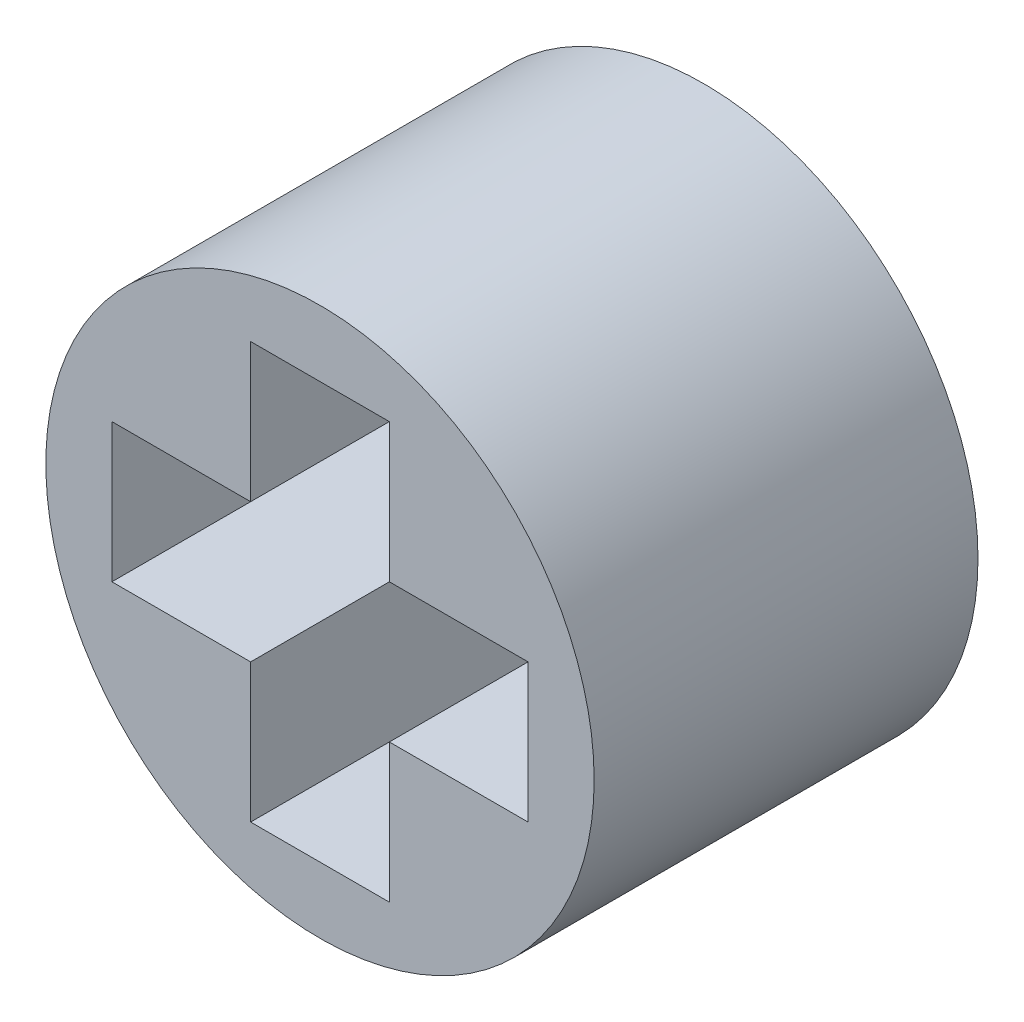
ISO-10303-21;
HEADER;
FILE_DESCRIPTION(('STEP AP214'),'2;1');
FILE_NAME('part.step','',(''),(''),'','','');
FILE_SCHEMA(('AUTOMOTIVE_DESIGN { 1 0 10303 214 1 1 1 1 }'));
ENDSEC;
DATA;
#1=APPLICATION_CONTEXT('core data for automotive mechanical design processes');
#2=APPLICATION_PROTOCOL_DEFINITION('international standard','automotive_design',2000,#1);
#3=PRODUCT_CONTEXT('',#1,'mechanical');
#4=PRODUCT('Part','Part','',(#3));
#5=PRODUCT_RELATED_PRODUCT_CATEGORY('part','',(#4));
#6=PRODUCT_DEFINITION_FORMATION('','',#4);
#7=PRODUCT_DEFINITION_CONTEXT('part definition',#1,'design');
#8=PRODUCT_DEFINITION('design','',#6,#7);
#9=PRODUCT_DEFINITION_SHAPE('','',#8);
#10=(LENGTH_UNIT() NAMED_UNIT(*) SI_UNIT(.MILLI.,.METRE.));
#11=(NAMED_UNIT(*) PLANE_ANGLE_UNIT() SI_UNIT($,.RADIAN.));
#12=(NAMED_UNIT(*) SI_UNIT($,.STERADIAN.) SOLID_ANGLE_UNIT());
#13=UNCERTAINTY_MEASURE_WITH_UNIT(LENGTH_MEASURE(1.E-05),#10,'distance_accuracy_value','');
#14=(GEOMETRIC_REPRESENTATION_CONTEXT(3) GLOBAL_UNCERTAINTY_ASSIGNED_CONTEXT((#13)) GLOBAL_UNIT_ASSIGNED_CONTEXT((#10,
#11,#12)) REPRESENTATION_CONTEXT('',''));
#15=CARTESIAN_POINT('',(0.,0.,0.));
#16=DIRECTION('',(0.,0.,1.));
#17=DIRECTION('',(1.,0.,0.));
#18=AXIS2_PLACEMENT_3D('',#15,#16,#17);
#19=CARTESIAN_POINT('',(0.,0.,7.));
#20=DIRECTION('',(0.,0.,1.));
#21=DIRECTION('',(1.,0.,0.));
#22=AXIS2_PLACEMENT_3D('',#19,#20,#21);
#23=PLANE('',#22);
#24=CARTESIAN_POINT('',(0.,0.,7.));
#25=DIRECTION('',(0.,0.,1.));
#26=DIRECTION('',(1.,0.,0.));
#27=AXIS2_PLACEMENT_3D('',#24,#25,#26);
#28=CIRCLE('',#27,5.);
#29=CARTESIAN_POINT('',(5.,0.,7.));
#30=VERTEX_POINT('',#29);
#31=EDGE_CURVE('E11',#30,#30,#28,.T.);
#32=ORIENTED_EDGE('',*,*,#31,.T.);
#33=EDGE_LOOP('',(#32));
#34=FACE_BOUND('',#33,.T.);
#35=DIRECTION('',(0.,-1.,0.));
#36=VECTOR('',#35,1.);
#37=CARTESIAN_POINT('',(-1.26491106406735,-3.79473319220206,7.));
#38=LINE('',#37,#36);
#39=CARTESIAN_POINT('',(-1.26491106406735,-1.26491106406735,7.));
#40=VERTEX_POINT('',#39);
#41=CARTESIAN_POINT('',(-1.26491106406735,-3.79473319220206,7.));
#42=VERTEX_POINT('',#41);
#43=EDGE_CURVE('E130',#40,#42,#38,.T.);
#44=ORIENTED_EDGE('',*,*,#43,.F.);
#45=DIRECTION('',(1.,0.,0.));
#46=VECTOR('',#45,1.);
#47=CARTESIAN_POINT('',(-1.26491106406735,-1.26491106406735,7.));
#48=LINE('',#47,#46);
#49=CARTESIAN_POINT('',(-3.79473319220205,-1.26491106406735,7.));
#50=VERTEX_POINT('',#49);
#51=EDGE_CURVE('E122',#50,#40,#48,.T.);
#52=ORIENTED_EDGE('',*,*,#51,.F.);
#53=DIRECTION('',(0.,-1.,0.));
#54=VECTOR('',#53,1.);
#55=CARTESIAN_POINT('',(-3.79473319220205,1.26491106406735,7.));
#56=LINE('',#55,#54);
#57=CARTESIAN_POINT('',(-3.79473319220205,1.26491106406735,7.));
#58=VERTEX_POINT('',#57);
#59=EDGE_CURVE('E162',#58,#50,#56,.T.);
#60=ORIENTED_EDGE('',*,*,#59,.F.);
#61=DIRECTION('',(-1.,0.,0.));
#62=VECTOR('',#61,1.);
#63=CARTESIAN_POINT('',(-3.79473319220205,1.26491106406735,7.));
#64=LINE('',#63,#62);
#65=CARTESIAN_POINT('',(-1.26491106406735,1.26491106406735,7.));
#66=VERTEX_POINT('',#65);
#67=EDGE_CURVE('E160',#66,#58,#64,.T.);
#68=ORIENTED_EDGE('',*,*,#67,.F.);
#69=DIRECTION('',(0.,-1.,0.));
#70=VECTOR('',#69,1.);
#71=CARTESIAN_POINT('',(-1.26491106406735,1.26491106406735,7.));
#72=LINE('',#71,#70);
#73=CARTESIAN_POINT('',(-1.26491106406735,3.79473319220206,7.));
#74=VERTEX_POINT('',#73);
#75=EDGE_CURVE('E158',#74,#66,#72,.T.);
#76=ORIENTED_EDGE('',*,*,#75,.F.);
#77=DIRECTION('',(-1.,0.,0.));
#78=VECTOR('',#77,1.);
#79=CARTESIAN_POINT('',(-1.26491106406735,3.79473319220206,7.));
#80=LINE('',#79,#78);
#81=CARTESIAN_POINT('',(1.26491106406735,3.79473319220206,7.));
#82=VERTEX_POINT('',#81);
#83=EDGE_CURVE('E156',#82,#74,#80,.T.);
#84=ORIENTED_EDGE('',*,*,#83,.F.);
#85=DIRECTION('',(0.,1.,0.));
#86=VECTOR('',#85,1.);
#87=CARTESIAN_POINT('',(1.26491106406735,3.79473319220206,7.));
#88=LINE('',#87,#86);
#89=CARTESIAN_POINT('',(1.26491106406735,1.26491106406735,7.));
#90=VERTEX_POINT('',#89);
#91=EDGE_CURVE('E154',#90,#82,#88,.T.);
#92=ORIENTED_EDGE('',*,*,#91,.F.);
#93=DIRECTION('',(-1.,0.,0.));
#94=VECTOR('',#93,1.);
#95=CARTESIAN_POINT('',(1.26491106406735,1.26491106406735,7.));
#96=LINE('',#95,#94);
#97=CARTESIAN_POINT('',(3.79473319220205,1.26491106406735,7.));
#98=VERTEX_POINT('',#97);
#99=EDGE_CURVE('E152',#98,#90,#96,.T.);
#100=ORIENTED_EDGE('',*,*,#99,.F.);
#101=DIRECTION('',(0.,1.,0.));
#102=VECTOR('',#101,1.);
#103=CARTESIAN_POINT('',(3.79473319220205,1.26491106406735,7.));
#104=LINE('',#103,#102);
#105=CARTESIAN_POINT('',(3.79473319220205,-1.26491106406735,7.));
#106=VERTEX_POINT('',#105);
#107=EDGE_CURVE('E150',#106,#98,#104,.T.);
#108=ORIENTED_EDGE('',*,*,#107,.F.);
#109=DIRECTION('',(1.,0.,0.));
#110=VECTOR('',#109,1.);
#111=CARTESIAN_POINT('',(3.79473319220205,-1.26491106406735,7.));
#112=LINE('',#111,#110);
#113=CARTESIAN_POINT('',(1.26491106406735,-1.26491106406735,7.));
#114=VERTEX_POINT('',#113);
#115=EDGE_CURVE('E148',#114,#106,#112,.T.);
#116=ORIENTED_EDGE('',*,*,#115,.F.);
#117=DIRECTION('',(0.,1.,0.));
#118=VECTOR('',#117,1.);
#119=CARTESIAN_POINT('',(1.26491106406735,-1.26491106406735,7.));
#120=LINE('',#119,#118);
#121=CARTESIAN_POINT('',(1.26491106406735,-3.79473319220206,7.));
#122=VERTEX_POINT('',#121);
#123=EDGE_CURVE('E144',#122,#114,#120,.T.);
#124=ORIENTED_EDGE('',*,*,#123,.F.);
#125=DIRECTION('',(1.,0.,0.));
#126=VECTOR('',#125,1.);
#127=CARTESIAN_POINT('',(1.26491106406735,-3.79473319220206,7.));
#128=LINE('',#127,#126);
#129=EDGE_CURVE('E142',#42,#122,#128,.T.);
#130=ORIENTED_EDGE('',*,*,#129,.F.);
#131=EDGE_LOOP('',(#44,#52,#60,#68,#76,#84,#92,#100,#108,#116,#124,#130));
#132=FACE_BOUND('',#131,.T.);
#133=ADVANCED_FACE('F33',(#34,#132),#23,.T.);
#134=CARTESIAN_POINT('',(0.,0.,0.));
#135=DIRECTION('',(0.,0.,1.));
#136=DIRECTION('',(1.,0.,0.));
#137=AXIS2_PLACEMENT_3D('',#134,#135,#136);
#138=PLANE('',#137);
#139=CARTESIAN_POINT('',(0.,0.,0.));
#140=DIRECTION('',(0.,0.,1.));
#141=DIRECTION('',(1.,0.,0.));
#142=AXIS2_PLACEMENT_3D('',#139,#140,#141);
#143=CIRCLE('',#142,5.);
#144=CARTESIAN_POINT('',(5.,0.,0.));
#145=VERTEX_POINT('',#144);
#146=EDGE_CURVE('E37',#145,#145,#143,.T.);
#147=ORIENTED_EDGE('',*,*,#146,.F.);
#148=EDGE_LOOP('',(#147));
#149=FACE_BOUND('',#148,.T.);
#150=DIRECTION('',(1.,0.,0.));
#151=VECTOR('',#150,1.);
#152=CARTESIAN_POINT('',(-1.26491106406735,-1.26491106406735,0.));
#153=LINE('',#152,#151);
#154=CARTESIAN_POINT('',(-3.79473319220205,-1.26491106406735,0.));
#155=VERTEX_POINT('',#154);
#156=CARTESIAN_POINT('',(-1.26491106406735,-1.26491106406735,0.));
#157=VERTEX_POINT('',#156);
#158=EDGE_CURVE('E56',#155,#157,#153,.T.);
#159=ORIENTED_EDGE('',*,*,#158,.T.);
#160=DIRECTION('',(0.,-1.,0.));
#161=VECTOR('',#160,1.);
#162=CARTESIAN_POINT('',(-1.26491106406735,-3.79473319220206,0.));
#163=LINE('',#162,#161);
#164=CARTESIAN_POINT('',(-1.26491106406735,-3.79473319220206,0.));
#165=VERTEX_POINT('',#164);
#166=EDGE_CURVE('E137',#157,#165,#163,.T.);
#167=ORIENTED_EDGE('',*,*,#166,.T.);
#168=DIRECTION('',(1.,0.,0.));
#169=VECTOR('',#168,1.);
#170=CARTESIAN_POINT('',(1.26491106406735,-3.79473319220206,0.));
#171=LINE('',#170,#169);
#172=CARTESIAN_POINT('',(1.26491106406735,-3.79473319220206,0.));
#173=VERTEX_POINT('',#172);
#174=EDGE_CURVE('E166',#165,#173,#171,.T.);
#175=ORIENTED_EDGE('',*,*,#174,.T.);
#176=DIRECTION('',(0.,1.,0.));
#177=VECTOR('',#176,1.);
#178=CARTESIAN_POINT('',(1.26491106406735,-1.26491106406735,0.));
#179=LINE('',#178,#177);
#180=CARTESIAN_POINT('',(1.26491106406735,-1.26491106406735,0.));
#181=VERTEX_POINT('',#180);
#182=EDGE_CURVE('E169',#173,#181,#179,.T.);
#183=ORIENTED_EDGE('',*,*,#182,.T.);
#184=DIRECTION('',(1.,0.,0.));
#185=VECTOR('',#184,1.);
#186=CARTESIAN_POINT('',(3.79473319220205,-1.26491106406735,0.));
#187=LINE('',#186,#185);
#188=CARTESIAN_POINT('',(3.79473319220205,-1.26491106406735,0.));
#189=VERTEX_POINT('',#188);
#190=EDGE_CURVE('E172',#181,#189,#187,.T.);
#191=ORIENTED_EDGE('',*,*,#190,.T.);
#192=DIRECTION('',(0.,1.,0.));
#193=VECTOR('',#192,1.);
#194=CARTESIAN_POINT('',(3.79473319220205,1.26491106406735,0.));
#195=LINE('',#194,#193);
#196=CARTESIAN_POINT('',(3.79473319220205,1.26491106406735,0.));
#197=VERTEX_POINT('',#196);
#198=EDGE_CURVE('E175',#189,#197,#195,.T.);
#199=ORIENTED_EDGE('',*,*,#198,.T.);
#200=DIRECTION('',(-1.,0.,0.));
#201=VECTOR('',#200,1.);
#202=CARTESIAN_POINT('',(1.26491106406735,1.26491106406735,0.));
#203=LINE('',#202,#201);
#204=CARTESIAN_POINT('',(1.26491106406735,1.26491106406735,0.));
#205=VERTEX_POINT('',#204);
#206=EDGE_CURVE('E178',#197,#205,#203,.T.);
#207=ORIENTED_EDGE('',*,*,#206,.T.);
#208=DIRECTION('',(0.,1.,0.));
#209=VECTOR('',#208,1.);
#210=CARTESIAN_POINT('',(1.26491106406735,3.79473319220206,0.));
#211=LINE('',#210,#209);
#212=CARTESIAN_POINT('',(1.26491106406735,3.79473319220206,0.));
#213=VERTEX_POINT('',#212);
#214=EDGE_CURVE('E181',#205,#213,#211,.T.);
#215=ORIENTED_EDGE('',*,*,#214,.T.);
#216=DIRECTION('',(-1.,0.,0.));
#217=VECTOR('',#216,1.);
#218=CARTESIAN_POINT('',(-1.26491106406735,3.79473319220206,0.));
#219=LINE('',#218,#217);
#220=CARTESIAN_POINT('',(-1.26491106406735,3.79473319220206,0.));
#221=VERTEX_POINT('',#220);
#222=EDGE_CURVE('E184',#213,#221,#219,.T.);
#223=ORIENTED_EDGE('',*,*,#222,.T.);
#224=DIRECTION('',(0.,-1.,0.));
#225=VECTOR('',#224,1.);
#226=CARTESIAN_POINT('',(-1.26491106406735,1.26491106406735,0.));
#227=LINE('',#226,#225);
#228=CARTESIAN_POINT('',(-1.26491106406735,1.26491106406735,0.));
#229=VERTEX_POINT('',#228);
#230=EDGE_CURVE('E187',#221,#229,#227,.T.);
#231=ORIENTED_EDGE('',*,*,#230,.T.);
#232=DIRECTION('',(-1.,0.,0.));
#233=VECTOR('',#232,1.);
#234=CARTESIAN_POINT('',(-3.79473319220205,1.26491106406735,0.));
#235=LINE('',#234,#233);
#236=CARTESIAN_POINT('',(-3.79473319220205,1.26491106406735,0.));
#237=VERTEX_POINT('',#236);
#238=EDGE_CURVE('E190',#229,#237,#235,.T.);
#239=ORIENTED_EDGE('',*,*,#238,.T.);
#240=DIRECTION('',(0.,-1.,0.));
#241=VECTOR('',#240,1.);
#242=CARTESIAN_POINT('',(-3.79473319220205,1.26491106406735,0.));
#243=LINE('',#242,#241);
#244=EDGE_CURVE('E131',#237,#155,#243,.T.);
#245=ORIENTED_EDGE('',*,*,#244,.T.);
#246=EDGE_LOOP('',(#159,#167,#175,#183,#191,#199,#207,#215,#223,#231,#239,#245));
#247=FACE_BOUND('',#246,.T.);
#248=ADVANCED_FACE('F219',(#149,#247),#138,.F.);
#249=CARTESIAN_POINT('',(0.,0.,7.));
#250=DIRECTION('',(0.,0.,-1.));
#251=DIRECTION('',(-1.,0.,0.));
#252=AXIS2_PLACEMENT_3D('',#249,#250,#251);
#253=CYLINDRICAL_SURFACE('',#252,5.);
#254=ORIENTED_EDGE('',*,*,#31,.F.);
#255=EDGE_LOOP('',(#254));
#256=FACE_BOUND('',#255,.T.);
#257=ORIENTED_EDGE('',*,*,#146,.T.);
#258=EDGE_LOOP('',(#257));
#259=FACE_BOUND('',#258,.T.);
#260=ADVANCED_FACE('F35',(#256,#259),#253,.T.);
#261=CARTESIAN_POINT('',(-1.26491106406735,-1.26491106406735,7.));
#262=DIRECTION('',(0.,1.,0.));
#263=DIRECTION('',(0.,0.,1.));
#264=AXIS2_PLACEMENT_3D('',#261,#262,#263);
#265=PLANE('',#264);
#266=ORIENTED_EDGE('',*,*,#158,.F.);
#267=DIRECTION('',(0.,0.,-1.));
#268=VECTOR('',#267,1.);
#269=CARTESIAN_POINT('',(-3.79473319220205,-1.26491106406735,7.));
#270=LINE('',#269,#268);
#271=EDGE_CURVE('E126',#50,#155,#270,.T.);
#272=ORIENTED_EDGE('',*,*,#271,.F.);
#273=ORIENTED_EDGE('',*,*,#51,.T.);
#274=DIRECTION('',(0.,0.,-1.));
#275=VECTOR('',#274,1.);
#276=CARTESIAN_POINT('',(-1.26491106406735,-1.26491106406735,7.));
#277=LINE('',#276,#275);
#278=EDGE_CURVE('E125',#40,#157,#277,.T.);
#279=ORIENTED_EDGE('',*,*,#278,.T.);
#280=EDGE_LOOP('',(#266,#272,#273,#279));
#281=FACE_BOUND('',#280,.T.);
#282=ADVANCED_FACE('F124',(#281),#265,.T.);
#283=CARTESIAN_POINT('',(-1.26491106406735,-3.79473319220206,7.));
#284=DIRECTION('',(1.,0.,0.));
#285=DIRECTION('',(0.,0.,-1.));
#286=AXIS2_PLACEMENT_3D('',#283,#284,#285);
#287=PLANE('',#286);
#288=ORIENTED_EDGE('',*,*,#166,.F.);
#289=ORIENTED_EDGE('',*,*,#278,.F.);
#290=ORIENTED_EDGE('',*,*,#43,.T.);
#291=DIRECTION('',(0.,0.,-1.));
#292=VECTOR('',#291,1.);
#293=CARTESIAN_POINT('',(-1.26491106406735,-3.79473319220206,7.));
#294=LINE('',#293,#292);
#295=EDGE_CURVE('E138',#42,#165,#294,.T.);
#296=ORIENTED_EDGE('',*,*,#295,.T.);
#297=EDGE_LOOP('',(#288,#289,#290,#296));
#298=FACE_BOUND('',#297,.T.);
#299=ADVANCED_FACE('F134',(#298),#287,.T.);
#300=CARTESIAN_POINT('',(1.26491106406735,-3.79473319220206,7.));
#301=DIRECTION('',(0.,1.,0.));
#302=DIRECTION('',(0.,0.,1.));
#303=AXIS2_PLACEMENT_3D('',#300,#301,#302);
#304=PLANE('',#303);
#305=ORIENTED_EDGE('',*,*,#174,.F.);
#306=ORIENTED_EDGE('',*,*,#295,.F.);
#307=ORIENTED_EDGE('',*,*,#129,.T.);
#308=DIRECTION('',(0.,0.,-1.));
#309=VECTOR('',#308,1.);
#310=CARTESIAN_POINT('',(1.26491106406735,-3.79473319220206,7.));
#311=LINE('',#310,#309);
#312=EDGE_CURVE('E211',#122,#173,#311,.T.);
#313=ORIENTED_EDGE('',*,*,#312,.T.);
#314=EDGE_LOOP('',(#305,#306,#307,#313));
#315=FACE_BOUND('',#314,.T.);
#316=ADVANCED_FACE('F215',(#315),#304,.T.);
#317=CARTESIAN_POINT('',(1.26491106406735,-1.26491106406735,7.));
#318=DIRECTION('',(-1.,0.,0.));
#319=DIRECTION('',(0.,0.,1.));
#320=AXIS2_PLACEMENT_3D('',#317,#318,#319);
#321=PLANE('',#320);
#322=ORIENTED_EDGE('',*,*,#182,.F.);
#323=ORIENTED_EDGE('',*,*,#312,.F.);
#324=ORIENTED_EDGE('',*,*,#123,.T.);
#325=DIRECTION('',(0.,0.,-1.));
#326=VECTOR('',#325,1.);
#327=CARTESIAN_POINT('',(1.26491106406735,-1.26491106406735,7.));
#328=LINE('',#327,#326);
#329=EDGE_CURVE('E209',#114,#181,#328,.T.);
#330=ORIENTED_EDGE('',*,*,#329,.T.);
#331=EDGE_LOOP('',(#322,#323,#324,#330));
#332=FACE_BOUND('',#331,.T.);
#333=ADVANCED_FACE('F257',(#332),#321,.T.);
#334=CARTESIAN_POINT('',(3.79473319220205,-1.26491106406735,7.));
#335=DIRECTION('',(0.,1.,0.));
#336=DIRECTION('',(0.,0.,1.));
#337=AXIS2_PLACEMENT_3D('',#334,#335,#336);
#338=PLANE('',#337);
#339=ORIENTED_EDGE('',*,*,#190,.F.);
#340=ORIENTED_EDGE('',*,*,#329,.F.);
#341=ORIENTED_EDGE('',*,*,#115,.T.);
#342=DIRECTION('',(0.,0.,-1.));
#343=VECTOR('',#342,1.);
#344=CARTESIAN_POINT('',(3.79473319220205,-1.26491106406735,7.));
#345=LINE('',#344,#343);
#346=EDGE_CURVE('E207',#106,#189,#345,.T.);
#347=ORIENTED_EDGE('',*,*,#346,.T.);
#348=EDGE_LOOP('',(#339,#340,#341,#347));
#349=FACE_BOUND('',#348,.T.);
#350=ADVANCED_FACE('F255',(#349),#338,.T.);
#351=CARTESIAN_POINT('',(3.79473319220205,1.26491106406735,7.));
#352=DIRECTION('',(-1.,0.,0.));
#353=DIRECTION('',(0.,0.,1.));
#354=AXIS2_PLACEMENT_3D('',#351,#352,#353);
#355=PLANE('',#354);
#356=ORIENTED_EDGE('',*,*,#198,.F.);
#357=ORIENTED_EDGE('',*,*,#346,.F.);
#358=ORIENTED_EDGE('',*,*,#107,.T.);
#359=DIRECTION('',(0.,0.,-1.));
#360=VECTOR('',#359,1.);
#361=CARTESIAN_POINT('',(3.79473319220205,1.26491106406735,7.));
#362=LINE('',#361,#360);
#363=EDGE_CURVE('E205',#98,#197,#362,.T.);
#364=ORIENTED_EDGE('',*,*,#363,.T.);
#365=EDGE_LOOP('',(#356,#357,#358,#364));
#366=FACE_BOUND('',#365,.T.);
#367=ADVANCED_FACE('F249',(#366),#355,.T.);
#368=CARTESIAN_POINT('',(1.26491106406735,1.26491106406735,7.));
#369=DIRECTION('',(0.,-1.,0.));
#370=DIRECTION('',(0.,0.,-1.));
#371=AXIS2_PLACEMENT_3D('',#368,#369,#370);
#372=PLANE('',#371);
#373=ORIENTED_EDGE('',*,*,#206,.F.);
#374=ORIENTED_EDGE('',*,*,#363,.F.);
#375=ORIENTED_EDGE('',*,*,#99,.T.);
#376=DIRECTION('',(0.,0.,-1.));
#377=VECTOR('',#376,1.);
#378=CARTESIAN_POINT('',(1.26491106406735,1.26491106406735,7.));
#379=LINE('',#378,#377);
#380=EDGE_CURVE('E203',#90,#205,#379,.T.);
#381=ORIENTED_EDGE('',*,*,#380,.T.);
#382=EDGE_LOOP('',(#373,#374,#375,#381));
#383=FACE_BOUND('',#382,.T.);
#384=ADVANCED_FACE('F245',(#383),#372,.T.);
#385=CARTESIAN_POINT('',(1.26491106406735,3.79473319220206,7.));
#386=DIRECTION('',(-1.,0.,0.));
#387=DIRECTION('',(0.,0.,1.));
#388=AXIS2_PLACEMENT_3D('',#385,#386,#387);
#389=PLANE('',#388);
#390=ORIENTED_EDGE('',*,*,#214,.F.);
#391=ORIENTED_EDGE('',*,*,#380,.F.);
#392=ORIENTED_EDGE('',*,*,#91,.T.);
#393=DIRECTION('',(0.,0.,-1.));
#394=VECTOR('',#393,1.);
#395=CARTESIAN_POINT('',(1.26491106406735,3.79473319220206,7.));
#396=LINE('',#395,#394);
#397=EDGE_CURVE('E201',#82,#213,#396,.T.);
#398=ORIENTED_EDGE('',*,*,#397,.T.);
#399=EDGE_LOOP('',(#390,#391,#392,#398));
#400=FACE_BOUND('',#399,.T.);
#401=ADVANCED_FACE('F242',(#400),#389,.T.);
#402=CARTESIAN_POINT('',(-1.26491106406735,3.79473319220206,7.));
#403=DIRECTION('',(0.,-1.,0.));
#404=DIRECTION('',(0.,0.,-1.));
#405=AXIS2_PLACEMENT_3D('',#402,#403,#404);
#406=PLANE('',#405);
#407=ORIENTED_EDGE('',*,*,#222,.F.);
#408=ORIENTED_EDGE('',*,*,#397,.F.);
#409=ORIENTED_EDGE('',*,*,#83,.T.);
#410=DIRECTION('',(0.,0.,-1.));
#411=VECTOR('',#410,1.);
#412=CARTESIAN_POINT('',(-1.26491106406735,3.79473319220206,7.));
#413=LINE('',#412,#411);
#414=EDGE_CURVE('E199',#74,#221,#413,.T.);
#415=ORIENTED_EDGE('',*,*,#414,.T.);
#416=EDGE_LOOP('',(#407,#408,#409,#415));
#417=FACE_BOUND('',#416,.T.);
#418=ADVANCED_FACE('F234',(#417),#406,.T.);
#419=CARTESIAN_POINT('',(-1.26491106406735,1.26491106406735,7.));
#420=DIRECTION('',(1.,0.,0.));
#421=DIRECTION('',(0.,0.,-1.));
#422=AXIS2_PLACEMENT_3D('',#419,#420,#421);
#423=PLANE('',#422);
#424=ORIENTED_EDGE('',*,*,#230,.F.);
#425=ORIENTED_EDGE('',*,*,#414,.F.);
#426=ORIENTED_EDGE('',*,*,#75,.T.);
#427=DIRECTION('',(0.,0.,-1.));
#428=VECTOR('',#427,1.);
#429=CARTESIAN_POINT('',(-1.26491106406735,1.26491106406735,7.));
#430=LINE('',#429,#428);
#431=EDGE_CURVE('E197',#66,#229,#430,.T.);
#432=ORIENTED_EDGE('',*,*,#431,.T.);
#433=EDGE_LOOP('',(#424,#425,#426,#432));
#434=FACE_BOUND('',#433,.T.);
#435=ADVANCED_FACE('F230',(#434),#423,.T.);
#436=CARTESIAN_POINT('',(-3.79473319220205,1.26491106406735,7.));
#437=DIRECTION('',(0.,-1.,0.));
#438=DIRECTION('',(0.,0.,-1.));
#439=AXIS2_PLACEMENT_3D('',#436,#437,#438);
#440=PLANE('',#439);
#441=ORIENTED_EDGE('',*,*,#238,.F.);
#442=ORIENTED_EDGE('',*,*,#431,.F.);
#443=ORIENTED_EDGE('',*,*,#67,.T.);
#444=DIRECTION('',(0.,0.,-1.));
#445=VECTOR('',#444,1.);
#446=CARTESIAN_POINT('',(-3.79473319220205,1.26491106406735,7.));
#447=LINE('',#446,#445);
#448=EDGE_CURVE('E48',#58,#237,#447,.T.);
#449=ORIENTED_EDGE('',*,*,#448,.T.);
#450=EDGE_LOOP('',(#441,#442,#443,#449));
#451=FACE_BOUND('',#450,.T.);
#452=ADVANCED_FACE('F227',(#451),#440,.T.);
#453=CARTESIAN_POINT('',(-3.79473319220205,1.26491106406735,7.));
#454=DIRECTION('',(1.,0.,0.));
#455=DIRECTION('',(0.,0.,-1.));
#456=AXIS2_PLACEMENT_3D('',#453,#454,#455);
#457=PLANE('',#456);
#458=ORIENTED_EDGE('',*,*,#244,.F.);
#459=ORIENTED_EDGE('',*,*,#448,.F.);
#460=ORIENTED_EDGE('',*,*,#59,.T.);
#461=ORIENTED_EDGE('',*,*,#271,.T.);
#462=EDGE_LOOP('',(#458,#459,#460,#461));
#463=FACE_BOUND('',#462,.T.);
#464=ADVANCED_FACE('F221',(#463),#457,.T.);
#465=CLOSED_SHELL('',(#133,#248,#260,#282,#299,#316,#333,#350,#367,#384,#401,#418,#435,#452,#464));
#466=MANIFOLD_SOLID_BREP('B2',#465);
#467=ADVANCED_BREP_SHAPE_REPRESENTATION('',(#18,#466),#14);
#468=SHAPE_DEFINITION_REPRESENTATION(#9,#467);
ENDSEC;
END-ISO-10303-21;
